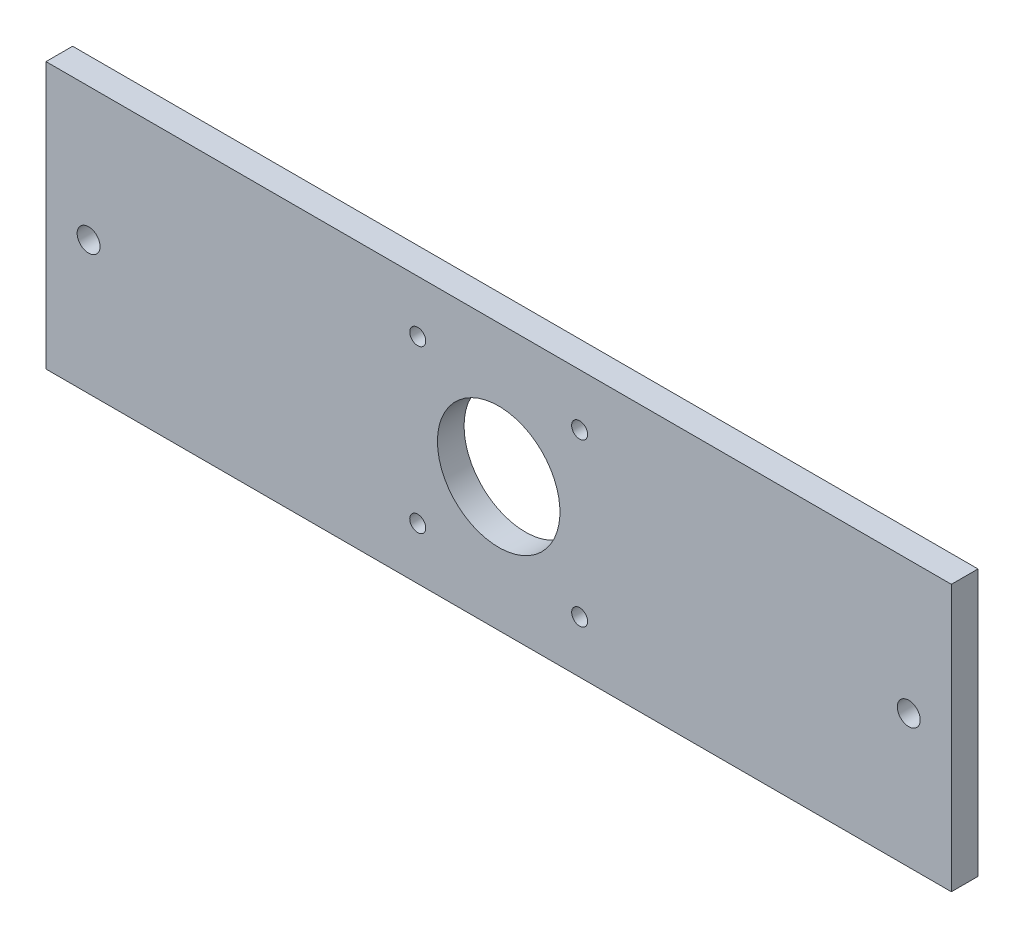
ISO-10303-21;
HEADER;
FILE_DESCRIPTION(('STEP AP214'),'2;1');
FILE_NAME('part.step','',(''),(''),'','','');
FILE_SCHEMA(('AUTOMOTIVE_DESIGN { 1 0 10303 214 1 1 1 1 }'));
ENDSEC;
DATA;
#1=APPLICATION_CONTEXT('core data for automotive mechanical design processes');
#2=APPLICATION_PROTOCOL_DEFINITION('international standard','automotive_design',2000,#1);
#3=PRODUCT_CONTEXT('',#1,'mechanical');
#4=PRODUCT('Part','Part','',(#3));
#5=PRODUCT_RELATED_PRODUCT_CATEGORY('part','',(#4));
#6=PRODUCT_DEFINITION_FORMATION('','',#4);
#7=PRODUCT_DEFINITION_CONTEXT('part definition',#1,'design');
#8=PRODUCT_DEFINITION('design','',#6,#7);
#9=PRODUCT_DEFINITION_SHAPE('','',#8);
#10=(LENGTH_UNIT() NAMED_UNIT(*) SI_UNIT(.MILLI.,.METRE.));
#11=(NAMED_UNIT(*) PLANE_ANGLE_UNIT() SI_UNIT($,.RADIAN.));
#12=(NAMED_UNIT(*) SI_UNIT($,.STERADIAN.) SOLID_ANGLE_UNIT());
#13=UNCERTAINTY_MEASURE_WITH_UNIT(LENGTH_MEASURE(1.E-05),#10,'distance_accuracy_value','');
#14=(GEOMETRIC_REPRESENTATION_CONTEXT(3) GLOBAL_UNCERTAINTY_ASSIGNED_CONTEXT((#13)) GLOBAL_UNIT_ASSIGNED_CONTEXT((#10,
#11,#12)) REPRESENTATION_CONTEXT('',''));
#15=CARTESIAN_POINT('',(0.,0.,0.));
#16=DIRECTION('',(0.,0.,1.));
#17=DIRECTION('',(1.,0.,0.));
#18=AXIS2_PLACEMENT_3D('',#15,#16,#17);
#19=CARTESIAN_POINT('',(0.,0.,5.));
#20=DIRECTION('',(0.,0.,-1.));
#21=DIRECTION('',(-1.,0.,0.));
#22=AXIS2_PLACEMENT_3D('',#19,#20,#21);
#23=PLANE('',#22);
#24=CARTESIAN_POINT('',(40.2000000000003,9.8000000000003,5.));
#25=DIRECTION('',(0.,0.,-1.));
#26=DIRECTION('',(-1.,0.,0.));
#27=AXIS2_PLACEMENT_3D('',#24,#25,#26);
#28=CIRCLE('',#27,1.50000000000001);
#29=CARTESIAN_POINT('',(38.7000000000003,9.8000000000003,5.));
#30=VERTEX_POINT('',#29);
#31=EDGE_CURVE('E129',#30,#30,#28,.F.);
#32=ORIENTED_EDGE('',*,*,#31,.F.);
#33=EDGE_LOOP('',(#32));
#34=FACE_BOUND('',#33,.T.);
#35=CARTESIAN_POINT('',(9.79999999999999,40.2,5.));
#36=DIRECTION('',(0.,0.,-1.));
#37=DIRECTION('',(-1.,0.,0.));
#38=AXIS2_PLACEMENT_3D('',#35,#36,#37);
#39=CIRCLE('',#38,1.5);
#40=CARTESIAN_POINT('',(8.29999999999999,40.2,5.));
#41=VERTEX_POINT('',#40);
#42=EDGE_CURVE('E122',#41,#41,#39,.F.);
#43=ORIENTED_EDGE('',*,*,#42,.F.);
#44=EDGE_LOOP('',(#43));
#45=FACE_BOUND('',#44,.T.);
#46=CARTESIAN_POINT('',(-52.,25.,5.));
#47=DIRECTION('',(0.,0.,-1.));
#48=DIRECTION('',(-1.,0.,0.));
#49=AXIS2_PLACEMENT_3D('',#46,#47,#48);
#50=CIRCLE('',#49,2.15);
#51=CARTESIAN_POINT('',(-54.15,25.,5.));
#52=VERTEX_POINT('',#51);
#53=EDGE_CURVE('E93',#52,#52,#50,.F.);
#54=ORIENTED_EDGE('',*,*,#53,.F.);
#55=EDGE_LOOP('',(#54));
#56=FACE_BOUND('',#55,.T.);
#57=CARTESIAN_POINT('',(25.,25.,5.));
#58=DIRECTION('',(0.,0.,-1.));
#59=DIRECTION('',(-1.,0.,0.));
#60=AXIS2_PLACEMENT_3D('',#57,#58,#59);
#61=CIRCLE('',#60,11.5);
#62=CARTESIAN_POINT('',(13.5,25.,5.));
#63=VERTEX_POINT('',#62);
#64=EDGE_CURVE('E108',#63,#63,#61,.T.);
#65=ORIENTED_EDGE('',*,*,#64,.T.);
#66=EDGE_LOOP('',(#65));
#67=FACE_BOUND('',#66,.T.);
#68=DIRECTION('',(-1.,0.,0.));
#69=VECTOR('',#68,1.);
#70=CARTESIAN_POINT('',(0.,50.,5.));
#71=LINE('',#70,#69);
#72=CARTESIAN_POINT('',(110.,50.,5.));
#73=VERTEX_POINT('',#72);
#74=CARTESIAN_POINT('',(-60.,50.,5.));
#75=VERTEX_POINT('',#74);
#76=EDGE_CURVE('E11',#73,#75,#71,.T.);
#77=ORIENTED_EDGE('',*,*,#76,.T.);
#78=DIRECTION('',(0.,-1.,0.));
#79=VECTOR('',#78,1.);
#80=CARTESIAN_POINT('',(-60.,50.,5.));
#81=LINE('',#80,#79);
#82=CARTESIAN_POINT('',(-60.,0.,5.));
#83=VERTEX_POINT('',#82);
#84=EDGE_CURVE('E100',#75,#83,#81,.T.);
#85=ORIENTED_EDGE('',*,*,#84,.T.);
#86=DIRECTION('',(1.,0.,0.));
#87=VECTOR('',#86,1.);
#88=CARTESIAN_POINT('',(0.,0.,5.));
#89=LINE('',#88,#87);
#90=CARTESIAN_POINT('',(110.,0.,5.));
#91=VERTEX_POINT('',#90);
#92=EDGE_CURVE('E43',#83,#91,#89,.T.);
#93=ORIENTED_EDGE('',*,*,#92,.T.);
#94=DIRECTION('',(0.,1.,0.));
#95=VECTOR('',#94,1.);
#96=CARTESIAN_POINT('',(110.,50.,5.));
#97=LINE('',#96,#95);
#98=EDGE_CURVE('E92',#91,#73,#97,.T.);
#99=ORIENTED_EDGE('',*,*,#98,.T.);
#100=EDGE_LOOP('',(#77,#85,#93,#99));
#101=FACE_BOUND('',#100,.T.);
#102=CARTESIAN_POINT('',(102.,25.,5.));
#103=DIRECTION('',(0.,0.,-1.));
#104=DIRECTION('',(-1.,0.,0.));
#105=AXIS2_PLACEMENT_3D('',#102,#103,#104);
#106=CIRCLE('',#105,2.15);
#107=CARTESIAN_POINT('',(99.85,25.,5.));
#108=VERTEX_POINT('',#107);
#109=EDGE_CURVE('E118',#108,#108,#106,.F.);
#110=ORIENTED_EDGE('',*,*,#109,.F.);
#111=EDGE_LOOP('',(#110));
#112=FACE_BOUND('',#111,.T.);
#113=CARTESIAN_POINT('',(40.2,40.2000000000003,5.));
#114=DIRECTION('',(0.,0.,-1.));
#115=DIRECTION('',(-1.,0.,0.));
#116=AXIS2_PLACEMENT_3D('',#113,#114,#115);
#117=CIRCLE('',#116,1.5);
#118=CARTESIAN_POINT('',(38.7,40.2000000000003,5.));
#119=VERTEX_POINT('',#118);
#120=EDGE_CURVE('E126',#119,#119,#117,.F.);
#121=ORIENTED_EDGE('',*,*,#120,.F.);
#122=EDGE_LOOP('',(#121));
#123=FACE_BOUND('',#122,.T.);
#124=CARTESIAN_POINT('',(9.80000000000023,9.80000000000016,5.));
#125=DIRECTION('',(0.,0.,-1.));
#126=DIRECTION('',(-1.,0.,0.));
#127=AXIS2_PLACEMENT_3D('',#124,#125,#126);
#128=CIRCLE('',#127,1.5);
#129=CARTESIAN_POINT('',(8.30000000000023,9.80000000000016,5.));
#130=VERTEX_POINT('',#129);
#131=EDGE_CURVE('E132',#130,#130,#128,.F.);
#132=ORIENTED_EDGE('',*,*,#131,.F.);
#133=EDGE_LOOP('',(#132));
#134=FACE_BOUND('',#133,.T.);
#135=ADVANCED_FACE('F33',(#34,#45,#56,#67,#101,#112,#123,#134),#23,.F.);
#136=CARTESIAN_POINT('',(0.,0.,0.));
#137=DIRECTION('',(0.,0.,-1.));
#138=DIRECTION('',(-1.,0.,0.));
#139=AXIS2_PLACEMENT_3D('',#136,#137,#138);
#140=PLANE('',#139);
#141=CARTESIAN_POINT('',(40.2000000000003,9.8000000000003,0.));
#142=DIRECTION('',(0.,0.,-1.));
#143=DIRECTION('',(-1.,0.,0.));
#144=AXIS2_PLACEMENT_3D('',#141,#142,#143);
#145=CIRCLE('',#144,1.50000000000001);
#146=CARTESIAN_POINT('',(38.7000000000003,9.8000000000003,0.));
#147=VERTEX_POINT('',#146);
#148=EDGE_CURVE('E130',#147,#147,#145,.F.);
#149=ORIENTED_EDGE('',*,*,#148,.T.);
#150=EDGE_LOOP('',(#149));
#151=FACE_BOUND('',#150,.T.);
#152=CARTESIAN_POINT('',(9.79999999999999,40.2,0.));
#153=DIRECTION('',(0.,0.,-1.));
#154=DIRECTION('',(-1.,0.,0.));
#155=AXIS2_PLACEMENT_3D('',#152,#153,#154);
#156=CIRCLE('',#155,1.5);
#157=CARTESIAN_POINT('',(8.29999999999999,40.2,0.));
#158=VERTEX_POINT('',#157);
#159=EDGE_CURVE('E123',#158,#158,#156,.F.);
#160=ORIENTED_EDGE('',*,*,#159,.T.);
#161=EDGE_LOOP('',(#160));
#162=FACE_BOUND('',#161,.T.);
#163=CARTESIAN_POINT('',(-52.,25.,0.));
#164=DIRECTION('',(0.,0.,-1.));
#165=DIRECTION('',(-1.,0.,0.));
#166=AXIS2_PLACEMENT_3D('',#163,#164,#165);
#167=CIRCLE('',#166,2.15);
#168=CARTESIAN_POINT('',(-54.15,25.,0.));
#169=VERTEX_POINT('',#168);
#170=EDGE_CURVE('E115',#169,#169,#167,.F.);
#171=ORIENTED_EDGE('',*,*,#170,.T.);
#172=EDGE_LOOP('',(#171));
#173=FACE_BOUND('',#172,.T.);
#174=CARTESIAN_POINT('',(25.,25.,0.));
#175=DIRECTION('',(0.,0.,-1.));
#176=DIRECTION('',(-1.,0.,0.));
#177=AXIS2_PLACEMENT_3D('',#174,#175,#176);
#178=CIRCLE('',#177,11.5);
#179=CARTESIAN_POINT('',(13.5,25.,0.));
#180=VERTEX_POINT('',#179);
#181=EDGE_CURVE('E107',#180,#180,#178,.T.);
#182=ORIENTED_EDGE('',*,*,#181,.F.);
#183=EDGE_LOOP('',(#182));
#184=FACE_BOUND('',#183,.T.);
#185=DIRECTION('',(1.,0.,0.));
#186=VECTOR('',#185,1.);
#187=CARTESIAN_POINT('',(0.,0.,0.));
#188=LINE('',#187,#186);
#189=CARTESIAN_POINT('',(-60.,0.,0.));
#190=VERTEX_POINT('',#189);
#191=CARTESIAN_POINT('',(110.,0.,0.));
#192=VERTEX_POINT('',#191);
#193=EDGE_CURVE('E83',#190,#192,#188,.T.);
#194=ORIENTED_EDGE('',*,*,#193,.F.);
#195=DIRECTION('',(0.,-1.,0.));
#196=VECTOR('',#195,1.);
#197=CARTESIAN_POINT('',(-60.,50.,0.));
#198=LINE('',#197,#196);
#199=CARTESIAN_POINT('',(-60.,50.,0.));
#200=VERTEX_POINT('',#199);
#201=EDGE_CURVE('E82',#200,#190,#198,.T.);
#202=ORIENTED_EDGE('',*,*,#201,.F.);
#203=DIRECTION('',(-1.,0.,0.));
#204=VECTOR('',#203,1.);
#205=CARTESIAN_POINT('',(0.,50.,0.));
#206=LINE('',#205,#204);
#207=CARTESIAN_POINT('',(110.,50.,0.));
#208=VERTEX_POINT('',#207);
#209=EDGE_CURVE('E62',#208,#200,#206,.T.);
#210=ORIENTED_EDGE('',*,*,#209,.F.);
#211=DIRECTION('',(0.,1.,0.));
#212=VECTOR('',#211,1.);
#213=CARTESIAN_POINT('',(110.,50.,0.));
#214=LINE('',#213,#212);
#215=EDGE_CURVE('E80',#192,#208,#214,.T.);
#216=ORIENTED_EDGE('',*,*,#215,.F.);
#217=EDGE_LOOP('',(#194,#202,#210,#216));
#218=FACE_BOUND('',#217,.T.);
#219=CARTESIAN_POINT('',(102.,25.,0.));
#220=DIRECTION('',(0.,0.,-1.));
#221=DIRECTION('',(-1.,0.,0.));
#222=AXIS2_PLACEMENT_3D('',#219,#220,#221);
#223=CIRCLE('',#222,2.15);
#224=CARTESIAN_POINT('',(99.85,25.,0.));
#225=VERTEX_POINT('',#224);
#226=EDGE_CURVE('E119',#225,#225,#223,.F.);
#227=ORIENTED_EDGE('',*,*,#226,.T.);
#228=EDGE_LOOP('',(#227));
#229=FACE_BOUND('',#228,.T.);
#230=CARTESIAN_POINT('',(40.2,40.2000000000003,0.));
#231=DIRECTION('',(0.,0.,-1.));
#232=DIRECTION('',(-1.,0.,0.));
#233=AXIS2_PLACEMENT_3D('',#230,#231,#232);
#234=CIRCLE('',#233,1.5);
#235=CARTESIAN_POINT('',(38.7,40.2000000000003,0.));
#236=VERTEX_POINT('',#235);
#237=EDGE_CURVE('E127',#236,#236,#234,.F.);
#238=ORIENTED_EDGE('',*,*,#237,.T.);
#239=EDGE_LOOP('',(#238));
#240=FACE_BOUND('',#239,.T.);
#241=CARTESIAN_POINT('',(9.80000000000023,9.80000000000016,0.));
#242=DIRECTION('',(0.,0.,-1.));
#243=DIRECTION('',(-1.,0.,0.));
#244=AXIS2_PLACEMENT_3D('',#241,#242,#243);
#245=CIRCLE('',#244,1.5);
#246=CARTESIAN_POINT('',(8.30000000000023,9.80000000000016,0.));
#247=VERTEX_POINT('',#246);
#248=EDGE_CURVE('E37',#247,#247,#245,.F.);
#249=ORIENTED_EDGE('',*,*,#248,.T.);
#250=EDGE_LOOP('',(#249));
#251=FACE_BOUND('',#250,.T.);
#252=ADVANCED_FACE('F78',(#151,#162,#173,#184,#218,#229,#240,#251),#140,.T.);
#253=CARTESIAN_POINT('',(0.,0.,5.));
#254=DIRECTION('',(0.,1.,0.));
#255=DIRECTION('',(0.,0.,1.));
#256=AXIS2_PLACEMENT_3D('',#253,#254,#255);
#257=PLANE('',#256);
#258=ORIENTED_EDGE('',*,*,#193,.T.);
#259=DIRECTION('',(0.,0.,-1.));
#260=VECTOR('',#259,1.);
#261=CARTESIAN_POINT('',(110.,0.,5.));
#262=LINE('',#261,#260);
#263=EDGE_CURVE('E91',#91,#192,#262,.T.);
#264=ORIENTED_EDGE('',*,*,#263,.F.);
#265=ORIENTED_EDGE('',*,*,#92,.F.);
#266=DIRECTION('',(0.,0.,-1.));
#267=VECTOR('',#266,1.);
#268=CARTESIAN_POINT('',(-60.,0.,5.));
#269=LINE('',#268,#267);
#270=EDGE_CURVE('E102',#83,#190,#269,.T.);
#271=ORIENTED_EDGE('',*,*,#270,.T.);
#272=EDGE_LOOP('',(#258,#264,#265,#271));
#273=FACE_BOUND('',#272,.T.);
#274=ADVANCED_FACE('F35',(#273),#257,.F.);
#275=CARTESIAN_POINT('',(0.,50.,5.));
#276=DIRECTION('',(0.,-1.,0.));
#277=DIRECTION('',(0.,0.,-1.));
#278=AXIS2_PLACEMENT_3D('',#275,#276,#277);
#279=PLANE('',#278);
#280=ORIENTED_EDGE('',*,*,#209,.T.);
#281=DIRECTION('',(0.,0.,-1.));
#282=VECTOR('',#281,1.);
#283=CARTESIAN_POINT('',(-60.,50.,5.));
#284=LINE('',#283,#282);
#285=EDGE_CURVE('E105',#75,#200,#284,.T.);
#286=ORIENTED_EDGE('',*,*,#285,.F.);
#287=ORIENTED_EDGE('',*,*,#76,.F.);
#288=DIRECTION('',(0.,0.,-1.));
#289=VECTOR('',#288,1.);
#290=CARTESIAN_POINT('',(110.,50.,5.));
#291=LINE('',#290,#289);
#292=EDGE_CURVE('E90',#73,#208,#291,.T.);
#293=ORIENTED_EDGE('',*,*,#292,.T.);
#294=EDGE_LOOP('',(#280,#286,#287,#293));
#295=FACE_BOUND('',#294,.T.);
#296=ADVANCED_FACE('F95',(#295),#279,.F.);
#297=CARTESIAN_POINT('',(25.,25.,-14.));
#298=DIRECTION('',(0.,0.,1.));
#299=DIRECTION('',(1.,0.,0.));
#300=AXIS2_PLACEMENT_3D('',#297,#298,#299);
#301=CYLINDRICAL_SURFACE('',#300,11.5);
#302=ORIENTED_EDGE('',*,*,#181,.T.);
#303=EDGE_LOOP('',(#302));
#304=FACE_BOUND('',#303,.T.);
#305=ORIENTED_EDGE('',*,*,#64,.F.);
#306=EDGE_LOOP('',(#305));
#307=FACE_BOUND('',#306,.T.);
#308=ADVANCED_FACE('F196',(#304,#307),#301,.F.);
#309=CARTESIAN_POINT('',(-60.,50.,5.));
#310=DIRECTION('',(1.,0.,0.));
#311=DIRECTION('',(0.,1.,0.));
#312=AXIS2_PLACEMENT_3D('',#309,#310,#311);
#313=PLANE('',#312);
#314=ORIENTED_EDGE('',*,*,#201,.T.);
#315=ORIENTED_EDGE('',*,*,#270,.F.);
#316=ORIENTED_EDGE('',*,*,#84,.F.);
#317=ORIENTED_EDGE('',*,*,#285,.T.);
#318=EDGE_LOOP('',(#314,#315,#316,#317));
#319=FACE_BOUND('',#318,.T.);
#320=ADVANCED_FACE('F193',(#319),#313,.F.);
#321=CARTESIAN_POINT('',(110.,50.,5.));
#322=DIRECTION('',(-1.,0.,0.));
#323=DIRECTION('',(0.,0.,1.));
#324=AXIS2_PLACEMENT_3D('',#321,#322,#323);
#325=PLANE('',#324);
#326=ORIENTED_EDGE('',*,*,#215,.T.);
#327=ORIENTED_EDGE('',*,*,#292,.F.);
#328=ORIENTED_EDGE('',*,*,#98,.F.);
#329=ORIENTED_EDGE('',*,*,#263,.T.);
#330=EDGE_LOOP('',(#326,#327,#328,#329));
#331=FACE_BOUND('',#330,.T.);
#332=ADVANCED_FACE('F88',(#331),#325,.F.);
#333=CARTESIAN_POINT('',(-52.,25.,19.));
#334=DIRECTION('',(0.,0.,-1.));
#335=DIRECTION('',(-1.,0.,0.));
#336=AXIS2_PLACEMENT_3D('',#333,#334,#335);
#337=CYLINDRICAL_SURFACE('',#336,2.15);
#338=ORIENTED_EDGE('',*,*,#170,.F.);
#339=EDGE_LOOP('',(#338));
#340=FACE_BOUND('',#339,.T.);
#341=ORIENTED_EDGE('',*,*,#53,.T.);
#342=EDGE_LOOP('',(#341));
#343=FACE_BOUND('',#342,.T.);
#344=ADVANCED_FACE('F152',(#340,#343),#337,.F.);
#345=CARTESIAN_POINT('',(102.,25.,19.));
#346=DIRECTION('',(0.,0.,-1.));
#347=DIRECTION('',(-1.,0.,0.));
#348=AXIS2_PLACEMENT_3D('',#345,#346,#347);
#349=CYLINDRICAL_SURFACE('',#348,2.15);
#350=ORIENTED_EDGE('',*,*,#226,.F.);
#351=EDGE_LOOP('',(#350));
#352=FACE_BOUND('',#351,.T.);
#353=ORIENTED_EDGE('',*,*,#109,.T.);
#354=EDGE_LOOP('',(#353));
#355=FACE_BOUND('',#354,.T.);
#356=ADVANCED_FACE('F179',(#352,#355),#349,.F.);
#357=CARTESIAN_POINT('',(9.79999999999999,40.2,19.));
#358=DIRECTION('',(0.,0.,-1.));
#359=DIRECTION('',(-1.,0.,0.));
#360=AXIS2_PLACEMENT_3D('',#357,#358,#359);
#361=CYLINDRICAL_SURFACE('',#360,1.5);
#362=ORIENTED_EDGE('',*,*,#159,.F.);
#363=EDGE_LOOP('',(#362));
#364=FACE_BOUND('',#363,.T.);
#365=ORIENTED_EDGE('',*,*,#42,.T.);
#366=EDGE_LOOP('',(#365));
#367=FACE_BOUND('',#366,.T.);
#368=ADVANCED_FACE('F169',(#364,#367),#361,.F.);
#369=CARTESIAN_POINT('',(40.2,40.2000000000003,19.));
#370=DIRECTION('',(0.,0.,-1.));
#371=DIRECTION('',(-1.,0.,0.));
#372=AXIS2_PLACEMENT_3D('',#369,#370,#371);
#373=CYLINDRICAL_SURFACE('',#372,1.5);
#374=ORIENTED_EDGE('',*,*,#237,.F.);
#375=EDGE_LOOP('',(#374));
#376=FACE_BOUND('',#375,.T.);
#377=ORIENTED_EDGE('',*,*,#120,.T.);
#378=EDGE_LOOP('',(#377));
#379=FACE_BOUND('',#378,.T.);
#380=ADVANCED_FACE('F166',(#376,#379),#373,.F.);
#381=CARTESIAN_POINT('',(40.2000000000003,9.8000000000003,19.));
#382=DIRECTION('',(0.,0.,-1.));
#383=DIRECTION('',(-1.,0.,0.));
#384=AXIS2_PLACEMENT_3D('',#381,#382,#383);
#385=CYLINDRICAL_SURFACE('',#384,1.50000000000001);
#386=ORIENTED_EDGE('',*,*,#148,.F.);
#387=EDGE_LOOP('',(#386));
#388=FACE_BOUND('',#387,.T.);
#389=ORIENTED_EDGE('',*,*,#31,.T.);
#390=EDGE_LOOP('',(#389));
#391=FACE_BOUND('',#390,.T.);
#392=ADVANCED_FACE('F168',(#388,#391),#385,.F.);
#393=CARTESIAN_POINT('',(9.80000000000023,9.80000000000016,19.));
#394=DIRECTION('',(0.,0.,-1.));
#395=DIRECTION('',(-1.,0.,0.));
#396=AXIS2_PLACEMENT_3D('',#393,#394,#395);
#397=CYLINDRICAL_SURFACE('',#396,1.5);
#398=ORIENTED_EDGE('',*,*,#248,.F.);
#399=EDGE_LOOP('',(#398));
#400=FACE_BOUND('',#399,.T.);
#401=ORIENTED_EDGE('',*,*,#131,.T.);
#402=EDGE_LOOP('',(#401));
#403=FACE_BOUND('',#402,.T.);
#404=ADVANCED_FACE('F176',(#400,#403),#397,.F.);
#405=CLOSED_SHELL('',(#135,#252,#274,#296,#308,#320,#332,#344,#356,#368,#380,#392,#404));
#406=MANIFOLD_SOLID_BREP('B2',#405);
#407=ADVANCED_BREP_SHAPE_REPRESENTATION('',(#18,#406),#14);
#408=SHAPE_DEFINITION_REPRESENTATION(#9,#407);
ENDSEC;
END-ISO-10303-21;
